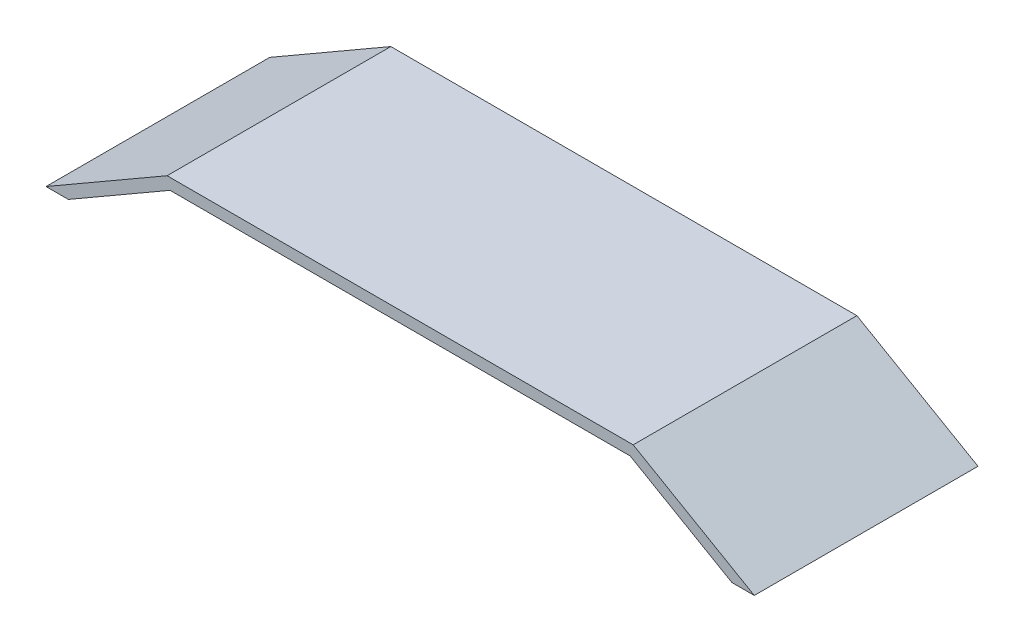
ISO-10303-21;
HEADER;
FILE_DESCRIPTION(('STEP AP214'),'2;1');
FILE_NAME('part.step','',(''),(''),'','','');
FILE_SCHEMA(('AUTOMOTIVE_DESIGN { 1 0 10303 214 1 1 1 1 }'));
ENDSEC;
DATA;
#1=APPLICATION_CONTEXT('core data for automotive mechanical design processes');
#2=APPLICATION_PROTOCOL_DEFINITION('international standard','automotive_design',2000,#1);
#3=PRODUCT_CONTEXT('',#1,'mechanical');
#4=PRODUCT('Part','Part','',(#3));
#5=PRODUCT_RELATED_PRODUCT_CATEGORY('part','',(#4));
#6=PRODUCT_DEFINITION_FORMATION('','',#4);
#7=PRODUCT_DEFINITION_CONTEXT('part definition',#1,'design');
#8=PRODUCT_DEFINITION('design','',#6,#7);
#9=PRODUCT_DEFINITION_SHAPE('','',#8);
#10=(LENGTH_UNIT() NAMED_UNIT(*) SI_UNIT(.MILLI.,.METRE.));
#11=(NAMED_UNIT(*) PLANE_ANGLE_UNIT() SI_UNIT($,.RADIAN.));
#12=(NAMED_UNIT(*) SI_UNIT($,.STERADIAN.) SOLID_ANGLE_UNIT());
#13=UNCERTAINTY_MEASURE_WITH_UNIT(LENGTH_MEASURE(1.E-05),#10,'distance_accuracy_value','');
#14=(GEOMETRIC_REPRESENTATION_CONTEXT(3) GLOBAL_UNCERTAINTY_ASSIGNED_CONTEXT((#13)) GLOBAL_UNIT_ASSIGNED_CONTEXT((#10,
#11,#12)) REPRESENTATION_CONTEXT('',''));
#15=CARTESIAN_POINT('',(0.,0.,0.));
#16=DIRECTION('',(0.,0.,1.));
#17=DIRECTION('',(1.,0.,0.));
#18=AXIS2_PLACEMENT_3D('',#15,#16,#17);
#19=CARTESIAN_POINT('',(-250.,0.,240.));
#20=DIRECTION('',(0.499999999999995,-0.866025403784442,0.));
#21=DIRECTION('',(0.866025403784442,0.499999999999995,0.));
#22=AXIS2_PLACEMENT_3D('',#19,#20,#21);
#23=PLANE('',#22);
#24=DIRECTION('',(-0.866025403784442,-0.499999999999995,0.));
#25=VECTOR('',#24,1.);
#26=CARTESIAN_POINT('',(-250.,0.,0.));
#27=LINE('',#26,#25);
#28=CARTESIAN_POINT('',(-250.,0.,0.));
#29=VERTEX_POINT('',#28);
#30=CARTESIAN_POINT('',(-379.903810567668,-75.,0.));
#31=VERTEX_POINT('',#30);
#32=EDGE_CURVE('E132',#29,#31,#27,.T.);
#33=ORIENTED_EDGE('',*,*,#32,.T.);
#34=DIRECTION('',(0.,0.,-1.));
#35=VECTOR('',#34,1.);
#36=CARTESIAN_POINT('',(-379.903810567668,-75.,240.));
#37=LINE('',#36,#35);
#38=CARTESIAN_POINT('',(-379.903810567668,-75.,240.));
#39=VERTEX_POINT('',#38);
#40=EDGE_CURVE('E11',#39,#31,#37,.T.);
#41=ORIENTED_EDGE('',*,*,#40,.F.);
#42=DIRECTION('',(-0.866025403784442,-0.499999999999995,0.));
#43=VECTOR('',#42,1.);
#44=CARTESIAN_POINT('',(-250.,0.,240.));
#45=LINE('',#44,#43);
#46=CARTESIAN_POINT('',(-250.,0.,240.));
#47=VERTEX_POINT('',#46);
#48=EDGE_CURVE('E146',#47,#39,#45,.T.);
#49=ORIENTED_EDGE('',*,*,#48,.F.);
#50=DIRECTION('',(0.,0.,-1.));
#51=VECTOR('',#50,1.);
#52=CARTESIAN_POINT('',(-250.,0.,240.));
#53=LINE('',#52,#51);
#54=EDGE_CURVE('E128',#47,#29,#53,.T.);
#55=ORIENTED_EDGE('',*,*,#54,.T.);
#56=EDGE_LOOP('',(#33,#41,#49,#55));
#57=FACE_BOUND('',#56,.T.);
#58=ADVANCED_FACE('F36',(#57),#23,.F.);
#59=CARTESIAN_POINT('',(-379.903810567668,-75.,240.));
#60=DIRECTION('',(0.,1.,0.));
#61=DIRECTION('',(0.,0.,1.));
#62=AXIS2_PLACEMENT_3D('',#59,#60,#61);
#63=PLANE('',#62);
#64=DIRECTION('',(1.,0.,0.));
#65=VECTOR('',#64,1.);
#66=CARTESIAN_POINT('',(-379.903810567668,-75.,0.));
#67=LINE('',#66,#65);
#68=CARTESIAN_POINT('',(-355.903810567667,-75.,0.));
#69=VERTEX_POINT('',#68);
#70=EDGE_CURVE('E135',#31,#69,#67,.T.);
#71=ORIENTED_EDGE('',*,*,#70,.T.);
#72=DIRECTION('',(0.,0.,-1.));
#73=VECTOR('',#72,1.);
#74=CARTESIAN_POINT('',(-355.903810567667,-75.,240.));
#75=LINE('',#74,#73);
#76=CARTESIAN_POINT('',(-355.903810567667,-75.,240.));
#77=VERTEX_POINT('',#76);
#78=EDGE_CURVE('E44',#77,#69,#75,.T.);
#79=ORIENTED_EDGE('',*,*,#78,.F.);
#80=DIRECTION('',(1.,0.,0.));
#81=VECTOR('',#80,1.);
#82=CARTESIAN_POINT('',(-379.903810567668,-75.,240.));
#83=LINE('',#82,#81);
#84=EDGE_CURVE('E95',#39,#77,#83,.T.);
#85=ORIENTED_EDGE('',*,*,#84,.F.);
#86=ORIENTED_EDGE('',*,*,#40,.T.);
#87=EDGE_LOOP('',(#71,#79,#85,#86));
#88=FACE_BOUND('',#87,.T.);
#89=ADVANCED_FACE('F181',(#88),#63,.F.);
#90=CARTESIAN_POINT('',(-246.784609690827,-12.,240.));
#91=DIRECTION('',(-0.499999999999995,0.866025403784441,0.));
#92=DIRECTION('',(-0.866025403784441,-0.499999999999995,0.));
#93=AXIS2_PLACEMENT_3D('',#90,#91,#92);
#94=PLANE('',#93);
#95=DIRECTION('',(0.866025403784441,0.499999999999995,0.));
#96=VECTOR('',#95,1.);
#97=CARTESIAN_POINT('',(-246.784609690827,-12.,0.));
#98=LINE('',#97,#96);
#99=CARTESIAN_POINT('',(-246.784609690827,-12.,0.));
#100=VERTEX_POINT('',#99);
#101=EDGE_CURVE('E137',#69,#100,#98,.T.);
#102=ORIENTED_EDGE('',*,*,#101,.T.);
#103=DIRECTION('',(0.,0.,-1.));
#104=VECTOR('',#103,1.);
#105=CARTESIAN_POINT('',(-246.784609690827,-12.,240.));
#106=LINE('',#105,#104);
#107=CARTESIAN_POINT('',(-246.784609690827,-12.,240.));
#108=VERTEX_POINT('',#107);
#109=EDGE_CURVE('E153',#108,#100,#106,.T.);
#110=ORIENTED_EDGE('',*,*,#109,.F.);
#111=DIRECTION('',(0.866025403784441,0.499999999999995,0.));
#112=VECTOR('',#111,1.);
#113=CARTESIAN_POINT('',(-246.784609690827,-12.,240.));
#114=LINE('',#113,#112);
#115=EDGE_CURVE('E161',#77,#108,#114,.T.);
#116=ORIENTED_EDGE('',*,*,#115,.F.);
#117=ORIENTED_EDGE('',*,*,#78,.T.);
#118=EDGE_LOOP('',(#102,#110,#116,#117));
#119=FACE_BOUND('',#118,.T.);
#120=ADVANCED_FACE('F159',(#119),#94,.F.);
#121=CARTESIAN_POINT('',(-246.784609690827,-12.,240.));
#122=DIRECTION('',(0.,1.,0.));
#123=DIRECTION('',(0.,0.,1.));
#124=AXIS2_PLACEMENT_3D('',#121,#122,#123);
#125=PLANE('',#124);
#126=DIRECTION('',(1.,0.,0.));
#127=VECTOR('',#126,1.);
#128=CARTESIAN_POINT('',(-246.784609690827,-12.,0.));
#129=LINE('',#128,#127);
#130=CARTESIAN_POINT('',(246.784609690827,-12.,0.));
#131=VERTEX_POINT('',#130);
#132=EDGE_CURVE('E139',#100,#131,#129,.T.);
#133=ORIENTED_EDGE('',*,*,#132,.T.);
#134=DIRECTION('',(0.,0.,-1.));
#135=VECTOR('',#134,1.);
#136=CARTESIAN_POINT('',(246.784609690827,-12.,240.));
#137=LINE('',#136,#135);
#138=CARTESIAN_POINT('',(246.784609690827,-12.,240.));
#139=VERTEX_POINT('',#138);
#140=EDGE_CURVE('E150',#139,#131,#137,.T.);
#141=ORIENTED_EDGE('',*,*,#140,.F.);
#142=DIRECTION('',(1.,0.,0.));
#143=VECTOR('',#142,1.);
#144=CARTESIAN_POINT('',(-246.784609690827,-12.,240.));
#145=LINE('',#144,#143);
#146=EDGE_CURVE('E173',#108,#139,#145,.T.);
#147=ORIENTED_EDGE('',*,*,#146,.F.);
#148=ORIENTED_EDGE('',*,*,#109,.T.);
#149=EDGE_LOOP('',(#133,#141,#147,#148));
#150=FACE_BOUND('',#149,.T.);
#151=ADVANCED_FACE('F169',(#150),#125,.F.);
#152=CARTESIAN_POINT('',(246.784609690827,-12.,240.));
#153=DIRECTION('',(0.500000000000001,0.866025403784438,0.));
#154=DIRECTION('',(-0.866025403784438,0.500000000000001,0.));
#155=AXIS2_PLACEMENT_3D('',#152,#153,#154);
#156=PLANE('',#155);
#157=DIRECTION('',(0.866025403784438,-0.500000000000001,0.));
#158=VECTOR('',#157,1.);
#159=CARTESIAN_POINT('',(246.784609690827,-12.,0.));
#160=LINE('',#159,#158);
#161=CARTESIAN_POINT('',(355.903810567666,-75.,0.));
#162=VERTEX_POINT('',#161);
#163=EDGE_CURVE('E141',#131,#162,#160,.T.);
#164=ORIENTED_EDGE('',*,*,#163,.T.);
#165=DIRECTION('',(0.,0.,-1.));
#166=VECTOR('',#165,1.);
#167=CARTESIAN_POINT('',(355.903810567666,-75.,240.));
#168=LINE('',#167,#166);
#169=CARTESIAN_POINT('',(355.903810567666,-75.,240.));
#170=VERTEX_POINT('',#169);
#171=EDGE_CURVE('E123',#170,#162,#168,.T.);
#172=ORIENTED_EDGE('',*,*,#171,.F.);
#173=DIRECTION('',(0.866025403784438,-0.500000000000001,0.));
#174=VECTOR('',#173,1.);
#175=CARTESIAN_POINT('',(246.784609690827,-12.,240.));
#176=LINE('',#175,#174);
#177=EDGE_CURVE('E114',#139,#170,#176,.T.);
#178=ORIENTED_EDGE('',*,*,#177,.F.);
#179=ORIENTED_EDGE('',*,*,#140,.T.);
#180=EDGE_LOOP('',(#164,#172,#178,#179));
#181=FACE_BOUND('',#180,.T.);
#182=ADVANCED_FACE('F172',(#181),#156,.F.);
#183=CARTESIAN_POINT('',(355.903810567666,-75.,240.));
#184=DIRECTION('',(0.,1.,0.));
#185=DIRECTION('',(0.,0.,1.));
#186=AXIS2_PLACEMENT_3D('',#183,#184,#185);
#187=PLANE('',#186);
#188=DIRECTION('',(1.,0.,0.));
#189=VECTOR('',#188,1.);
#190=CARTESIAN_POINT('',(355.903810567666,-75.,0.));
#191=LINE('',#190,#189);
#192=CARTESIAN_POINT('',(379.903810567665,-75.,0.));
#193=VERTEX_POINT('',#192);
#194=EDGE_CURVE('E122',#162,#193,#191,.T.);
#195=ORIENTED_EDGE('',*,*,#194,.T.);
#196=DIRECTION('',(0.,0.,-1.));
#197=VECTOR('',#196,1.);
#198=CARTESIAN_POINT('',(379.903810567665,-75.,240.));
#199=LINE('',#198,#197);
#200=CARTESIAN_POINT('',(379.903810567665,-75.,240.));
#201=VERTEX_POINT('',#200);
#202=EDGE_CURVE('E119',#201,#193,#199,.T.);
#203=ORIENTED_EDGE('',*,*,#202,.F.);
#204=DIRECTION('',(1.,0.,0.));
#205=VECTOR('',#204,1.);
#206=CARTESIAN_POINT('',(355.903810567666,-75.,240.));
#207=LINE('',#206,#205);
#208=EDGE_CURVE('E108',#170,#201,#207,.T.);
#209=ORIENTED_EDGE('',*,*,#208,.F.);
#210=ORIENTED_EDGE('',*,*,#171,.T.);
#211=EDGE_LOOP('',(#195,#203,#209,#210));
#212=FACE_BOUND('',#211,.T.);
#213=ADVANCED_FACE('F120',(#212),#187,.F.);
#214=CARTESIAN_POINT('',(250.,0.,240.));
#215=DIRECTION('',(-0.500000000000001,-0.866025403784438,0.));
#216=DIRECTION('',(0.866025403784438,-0.500000000000001,0.));
#217=AXIS2_PLACEMENT_3D('',#214,#215,#216);
#218=PLANE('',#217);
#219=DIRECTION('',(-0.866025403784438,0.500000000000001,0.));
#220=VECTOR('',#219,1.);
#221=CARTESIAN_POINT('',(250.,0.,0.));
#222=LINE('',#221,#220);
#223=CARTESIAN_POINT('',(250.,0.,0.));
#224=VERTEX_POINT('',#223);
#225=EDGE_CURVE('E81',#193,#224,#222,.T.);
#226=ORIENTED_EDGE('',*,*,#225,.T.);
#227=DIRECTION('',(0.,0.,-1.));
#228=VECTOR('',#227,1.);
#229=CARTESIAN_POINT('',(250.,0.,240.));
#230=LINE('',#229,#228);
#231=CARTESIAN_POINT('',(250.,0.,240.));
#232=VERTEX_POINT('',#231);
#233=EDGE_CURVE('E124',#232,#224,#230,.T.);
#234=ORIENTED_EDGE('',*,*,#233,.F.);
#235=DIRECTION('',(-0.866025403784438,0.500000000000001,0.));
#236=VECTOR('',#235,1.);
#237=CARTESIAN_POINT('',(250.,0.,240.));
#238=LINE('',#237,#236);
#239=EDGE_CURVE('E112',#201,#232,#238,.T.);
#240=ORIENTED_EDGE('',*,*,#239,.F.);
#241=ORIENTED_EDGE('',*,*,#202,.T.);
#242=EDGE_LOOP('',(#226,#234,#240,#241));
#243=FACE_BOUND('',#242,.T.);
#244=ADVANCED_FACE('F126',(#243),#218,.F.);
#245=CARTESIAN_POINT('',(-250.,0.,240.));
#246=DIRECTION('',(0.,-1.,0.));
#247=DIRECTION('',(0.,0.,-1.));
#248=AXIS2_PLACEMENT_3D('',#245,#246,#247);
#249=PLANE('',#248);
#250=DIRECTION('',(-1.,0.,0.));
#251=VECTOR('',#250,1.);
#252=CARTESIAN_POINT('',(-250.,0.,0.));
#253=LINE('',#252,#251);
#254=EDGE_CURVE('E87',#224,#29,#253,.T.);
#255=ORIENTED_EDGE('',*,*,#254,.T.);
#256=ORIENTED_EDGE('',*,*,#54,.F.);
#257=DIRECTION('',(-1.,0.,0.));
#258=VECTOR('',#257,1.);
#259=CARTESIAN_POINT('',(-250.,0.,240.));
#260=LINE('',#259,#258);
#261=EDGE_CURVE('E52',#232,#47,#260,.T.);
#262=ORIENTED_EDGE('',*,*,#261,.F.);
#263=ORIENTED_EDGE('',*,*,#233,.T.);
#264=EDGE_LOOP('',(#255,#256,#262,#263));
#265=FACE_BOUND('',#264,.T.);
#266=ADVANCED_FACE('F197',(#265),#249,.F.);
#267=CARTESIAN_POINT('',(0.,0.,240.));
#268=DIRECTION('',(0.,0.,1.));
#269=DIRECTION('',(1.,0.,0.));
#270=AXIS2_PLACEMENT_3D('',#267,#268,#269);
#271=PLANE('',#270);
#272=ORIENTED_EDGE('',*,*,#48,.T.);
#273=ORIENTED_EDGE('',*,*,#84,.T.);
#274=ORIENTED_EDGE('',*,*,#115,.T.);
#275=ORIENTED_EDGE('',*,*,#146,.T.);
#276=ORIENTED_EDGE('',*,*,#177,.T.);
#277=ORIENTED_EDGE('',*,*,#208,.T.);
#278=ORIENTED_EDGE('',*,*,#239,.T.);
#279=ORIENTED_EDGE('',*,*,#261,.T.);
#280=EDGE_LOOP('',(#272,#273,#274,#275,#276,#277,#278,#279));
#281=FACE_BOUND('',#280,.T.);
#282=ADVANCED_FACE('F110',(#281),#271,.T.);
#283=CARTESIAN_POINT('',(0.,0.,0.));
#284=DIRECTION('',(0.,0.,1.));
#285=DIRECTION('',(1.,0.,0.));
#286=AXIS2_PLACEMENT_3D('',#283,#284,#285);
#287=PLANE('',#286);
#288=ORIENTED_EDGE('',*,*,#32,.F.);
#289=ORIENTED_EDGE('',*,*,#254,.F.);
#290=ORIENTED_EDGE('',*,*,#225,.F.);
#291=ORIENTED_EDGE('',*,*,#194,.F.);
#292=ORIENTED_EDGE('',*,*,#163,.F.);
#293=ORIENTED_EDGE('',*,*,#132,.F.);
#294=ORIENTED_EDGE('',*,*,#101,.F.);
#295=ORIENTED_EDGE('',*,*,#70,.F.);
#296=EDGE_LOOP('',(#288,#289,#290,#291,#292,#293,#294,#295));
#297=FACE_BOUND('',#296,.T.);
#298=ADVANCED_FACE('F165',(#297),#287,.F.);
#299=CLOSED_SHELL('',(#58,#89,#120,#151,#182,#213,#244,#266,#282,#298));
#300=MANIFOLD_SOLID_BREP('B2',#299);
#301=ADVANCED_BREP_SHAPE_REPRESENTATION('',(#18,#300),#14);
#302=SHAPE_DEFINITION_REPRESENTATION(#9,#301);
ENDSEC;
END-ISO-10303-21;
